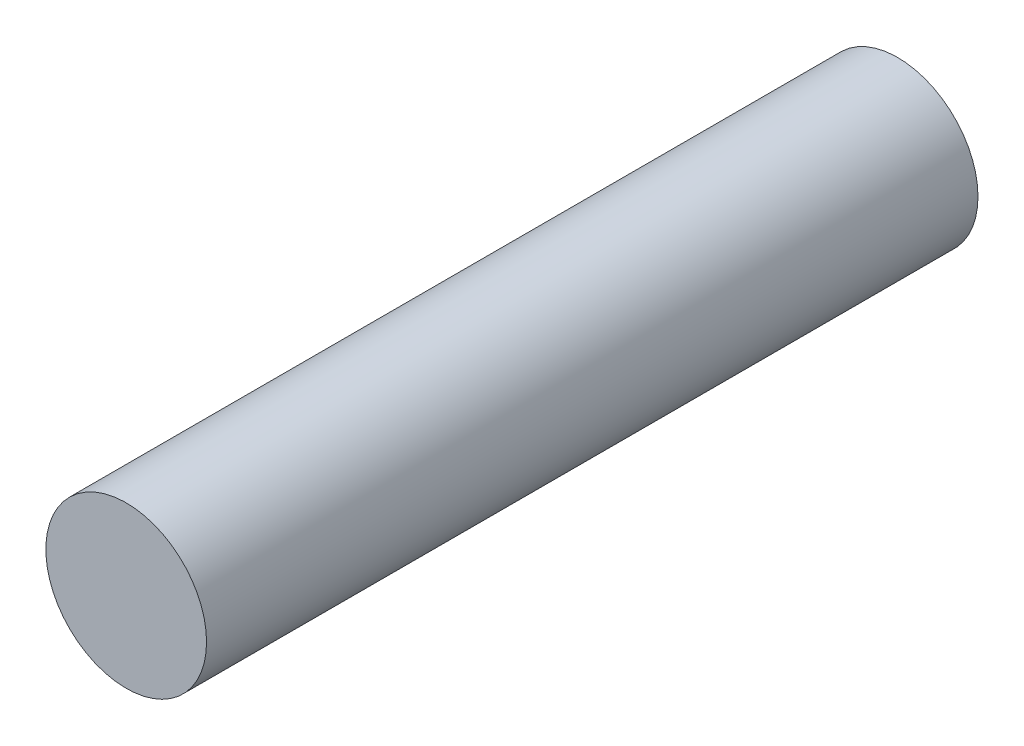
ISO-10303-21;
HEADER;
FILE_DESCRIPTION(('STEP AP214'),'2;1');
FILE_NAME('part.step','',(''),(''),'','','');
FILE_SCHEMA(('AUTOMOTIVE_DESIGN { 1 0 10303 214 1 1 1 1 }'));
ENDSEC;
DATA;
#1=APPLICATION_CONTEXT('core data for automotive mechanical design processes');
#2=APPLICATION_PROTOCOL_DEFINITION('international standard','automotive_design',2000,#1);
#3=PRODUCT_CONTEXT('',#1,'mechanical');
#4=PRODUCT('Part','Part','',(#3));
#5=PRODUCT_RELATED_PRODUCT_CATEGORY('part','',(#4));
#6=PRODUCT_DEFINITION_FORMATION('','',#4);
#7=PRODUCT_DEFINITION_CONTEXT('part definition',#1,'design');
#8=PRODUCT_DEFINITION('design','',#6,#7);
#9=PRODUCT_DEFINITION_SHAPE('','',#8);
#10=(LENGTH_UNIT() NAMED_UNIT(*) SI_UNIT(.MILLI.,.METRE.));
#11=(NAMED_UNIT(*) PLANE_ANGLE_UNIT() SI_UNIT($,.RADIAN.));
#12=(NAMED_UNIT(*) SI_UNIT($,.STERADIAN.) SOLID_ANGLE_UNIT());
#13=UNCERTAINTY_MEASURE_WITH_UNIT(LENGTH_MEASURE(1.E-05),#10,'distance_accuracy_value','');
#14=(GEOMETRIC_REPRESENTATION_CONTEXT(3) GLOBAL_UNCERTAINTY_ASSIGNED_CONTEXT((#13)) GLOBAL_UNIT_ASSIGNED_CONTEXT((#10,
#11,#12)) REPRESENTATION_CONTEXT('',''));
#15=CARTESIAN_POINT('',(0.,0.,0.));
#16=DIRECTION('',(0.,0.,1.));
#17=DIRECTION('',(1.,0.,0.));
#18=AXIS2_PLACEMENT_3D('',#15,#16,#17);
#19=CARTESIAN_POINT('',(0.,0.,36.));
#20=DIRECTION('',(0.,0.,-1.));
#21=DIRECTION('',(-1.,0.,0.));
#22=AXIS2_PLACEMENT_3D('',#19,#20,#21);
#23=CYLINDRICAL_SURFACE('',#22,7.5);
#24=CARTESIAN_POINT('',(0.,0.,36.));
#25=DIRECTION('',(0.,0.,1.));
#26=DIRECTION('',(1.,0.,0.));
#27=AXIS2_PLACEMENT_3D('',#24,#25,#26);
#28=CIRCLE('',#27,7.5);
#29=CARTESIAN_POINT('',(7.5,0.,36.));
#30=VERTEX_POINT('',#29);
#31=EDGE_CURVE('E10',#30,#30,#28,.T.);
#32=ORIENTED_EDGE('',*,*,#31,.F.);
#33=EDGE_LOOP('',(#32));
#34=FACE_BOUND('',#33,.T.);
#35=CARTESIAN_POINT('',(0.,0.,-36.));
#36=DIRECTION('',(0.,0.,1.));
#37=DIRECTION('',(1.,0.,0.));
#38=AXIS2_PLACEMENT_3D('',#35,#36,#37);
#39=CIRCLE('',#38,7.5);
#40=CARTESIAN_POINT('',(7.5,0.,-36.));
#41=VERTEX_POINT('',#40);
#42=EDGE_CURVE('E37',#41,#41,#39,.T.);
#43=ORIENTED_EDGE('',*,*,#42,.T.);
#44=EDGE_LOOP('',(#43));
#45=FACE_BOUND('',#44,.T.);
#46=ADVANCED_FACE('F34',(#34,#45),#23,.T.);
#47=CARTESIAN_POINT('',(0.,0.,36.));
#48=DIRECTION('',(0.,0.,1.));
#49=DIRECTION('',(1.,0.,0.));
#50=AXIS2_PLACEMENT_3D('',#47,#48,#49);
#51=PLANE('',#50);
#52=ORIENTED_EDGE('',*,*,#31,.T.);
#53=EDGE_LOOP('',(#52));
#54=FACE_BOUND('',#53,.T.);
#55=ADVANCED_FACE('F49',(#54),#51,.T.);
#56=CARTESIAN_POINT('',(0.,0.,-36.));
#57=DIRECTION('',(0.,0.,1.));
#58=DIRECTION('',(1.,0.,0.));
#59=AXIS2_PLACEMENT_3D('',#56,#57,#58);
#60=PLANE('',#59);
#61=ORIENTED_EDGE('',*,*,#42,.F.);
#62=EDGE_LOOP('',(#61));
#63=FACE_BOUND('',#62,.T.);
#64=ADVANCED_FACE('F47',(#63),#60,.F.);
#65=CLOSED_SHELL('',(#46,#55,#64));
#66=MANIFOLD_SOLID_BREP('B2',#65);
#67=ADVANCED_BREP_SHAPE_REPRESENTATION('',(#18,#66),#14);
#68=SHAPE_DEFINITION_REPRESENTATION(#9,#67);
ENDSEC;
END-ISO-10303-21;
